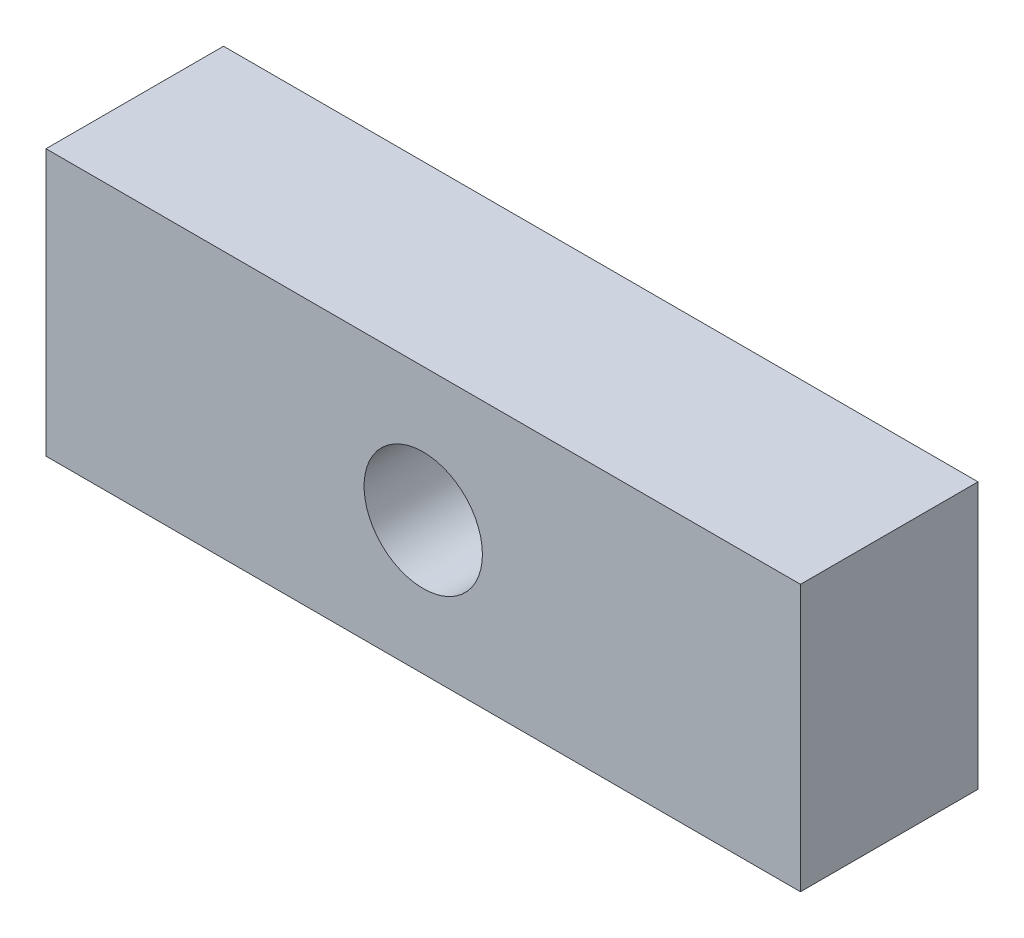
ISO-10303-21;
HEADER;
FILE_DESCRIPTION(('STEP AP214'),'2;1');
FILE_NAME('part.step','',(''),(''),'','','');
FILE_SCHEMA(('AUTOMOTIVE_DESIGN { 1 0 10303 214 1 1 1 1 }'));
ENDSEC;
DATA;
#1=APPLICATION_CONTEXT('core data for automotive mechanical design processes');
#2=APPLICATION_PROTOCOL_DEFINITION('international standard','automotive_design',2000,#1);
#3=PRODUCT_CONTEXT('',#1,'mechanical');
#4=PRODUCT('Part','Part','',(#3));
#5=PRODUCT_RELATED_PRODUCT_CATEGORY('part','',(#4));
#6=PRODUCT_DEFINITION_FORMATION('','',#4);
#7=PRODUCT_DEFINITION_CONTEXT('part definition',#1,'design');
#8=PRODUCT_DEFINITION('design','',#6,#7);
#9=PRODUCT_DEFINITION_SHAPE('','',#8);
#10=(LENGTH_UNIT() NAMED_UNIT(*) SI_UNIT(.MILLI.,.METRE.));
#11=(NAMED_UNIT(*) PLANE_ANGLE_UNIT() SI_UNIT($,.RADIAN.));
#12=(NAMED_UNIT(*) SI_UNIT($,.STERADIAN.) SOLID_ANGLE_UNIT());
#13=UNCERTAINTY_MEASURE_WITH_UNIT(LENGTH_MEASURE(1.E-05),#10,'distance_accuracy_value','');
#14=(GEOMETRIC_REPRESENTATION_CONTEXT(3) GLOBAL_UNCERTAINTY_ASSIGNED_CONTEXT((#13)) GLOBAL_UNIT_ASSIGNED_CONTEXT((#10,
#11,#12)) REPRESENTATION_CONTEXT('',''));
#15=CARTESIAN_POINT('',(0.,0.,0.));
#16=DIRECTION('',(0.,0.,1.));
#17=DIRECTION('',(1.,0.,0.));
#18=AXIS2_PLACEMENT_3D('',#15,#16,#17);
#19=CARTESIAN_POINT('',(0.,0.,3.));
#20=DIRECTION('',(1.,0.,0.));
#21=DIRECTION('',(0.,1.,0.));
#22=AXIS2_PLACEMENT_3D('',#19,#20,#21);
#23=PLANE('',#22);
#24=DIRECTION('',(0.,-1.,0.));
#25=VECTOR('',#24,1.);
#26=CARTESIAN_POINT('',(0.,0.,0.));
#27=LINE('',#26,#25);
#28=CARTESIAN_POINT('',(0.,0.,0.));
#29=VERTEX_POINT('',#28);
#30=CARTESIAN_POINT('',(0.,-4.5,0.));
#31=VERTEX_POINT('',#30);
#32=EDGE_CURVE('E96',#29,#31,#27,.T.);
#33=ORIENTED_EDGE('',*,*,#32,.T.);
#34=DIRECTION('',(0.,0.,-1.));
#35=VECTOR('',#34,1.);
#36=CARTESIAN_POINT('',(0.,-4.5,3.));
#37=LINE('',#36,#35);
#38=CARTESIAN_POINT('',(0.,-4.5,3.));
#39=VERTEX_POINT('',#38);
#40=EDGE_CURVE('E11',#39,#31,#37,.T.);
#41=ORIENTED_EDGE('',*,*,#40,.F.);
#42=DIRECTION('',(0.,-1.,0.));
#43=VECTOR('',#42,1.);
#44=CARTESIAN_POINT('',(0.,0.,3.));
#45=LINE('',#44,#43);
#46=CARTESIAN_POINT('',(0.,0.,3.));
#47=VERTEX_POINT('',#46);
#48=EDGE_CURVE('E84',#47,#39,#45,.T.);
#49=ORIENTED_EDGE('',*,*,#48,.F.);
#50=DIRECTION('',(0.,0.,-1.));
#51=VECTOR('',#50,1.);
#52=CARTESIAN_POINT('',(0.,0.,3.));
#53=LINE('',#52,#51);
#54=EDGE_CURVE('E92',#47,#29,#53,.T.);
#55=ORIENTED_EDGE('',*,*,#54,.T.);
#56=EDGE_LOOP('',(#33,#41,#49,#55));
#57=FACE_BOUND('',#56,.T.);
#58=ADVANCED_FACE('F33',(#57),#23,.F.);
#59=CARTESIAN_POINT('',(0.,-4.5,3.));
#60=DIRECTION('',(0.,1.,0.));
#61=DIRECTION('',(0.,0.,1.));
#62=AXIS2_PLACEMENT_3D('',#59,#60,#61);
#63=PLANE('',#62);
#64=DIRECTION('',(1.,0.,0.));
#65=VECTOR('',#64,1.);
#66=CARTESIAN_POINT('',(0.,-4.5,0.));
#67=LINE('',#66,#65);
#68=CARTESIAN_POINT('',(12.75,-4.5,0.));
#69=VERTEX_POINT('',#68);
#70=EDGE_CURVE('E88',#31,#69,#67,.T.);
#71=ORIENTED_EDGE('',*,*,#70,.T.);
#72=DIRECTION('',(0.,0.,-1.));
#73=VECTOR('',#72,1.);
#74=CARTESIAN_POINT('',(12.75,-4.5,3.));
#75=LINE('',#74,#73);
#76=CARTESIAN_POINT('',(12.75,-4.5,3.));
#77=VERTEX_POINT('',#76);
#78=EDGE_CURVE('E41',#77,#69,#75,.T.);
#79=ORIENTED_EDGE('',*,*,#78,.F.);
#80=DIRECTION('',(1.,0.,0.));
#81=VECTOR('',#80,1.);
#82=CARTESIAN_POINT('',(0.,-4.5,3.));
#83=LINE('',#82,#81);
#84=EDGE_CURVE('E79',#39,#77,#83,.T.);
#85=ORIENTED_EDGE('',*,*,#84,.F.);
#86=ORIENTED_EDGE('',*,*,#40,.T.);
#87=EDGE_LOOP('',(#71,#79,#85,#86));
#88=FACE_BOUND('',#87,.T.);
#89=ADVANCED_FACE('F87',(#88),#63,.F.);
#90=CARTESIAN_POINT('',(12.75,0.,3.));
#91=DIRECTION('',(-1.,0.,0.));
#92=DIRECTION('',(0.,0.,1.));
#93=AXIS2_PLACEMENT_3D('',#90,#91,#92);
#94=PLANE('',#93);
#95=DIRECTION('',(0.,1.,0.));
#96=VECTOR('',#95,1.);
#97=CARTESIAN_POINT('',(12.75,0.,0.));
#98=LINE('',#97,#96);
#99=CARTESIAN_POINT('',(12.75,0.,0.));
#100=VERTEX_POINT('',#99);
#101=EDGE_CURVE('E66',#69,#100,#98,.T.);
#102=ORIENTED_EDGE('',*,*,#101,.T.);
#103=DIRECTION('',(0.,0.,-1.));
#104=VECTOR('',#103,1.);
#105=CARTESIAN_POINT('',(12.75,0.,3.));
#106=LINE('',#105,#104);
#107=CARTESIAN_POINT('',(12.75,0.,3.));
#108=VERTEX_POINT('',#107);
#109=EDGE_CURVE('E89',#108,#100,#106,.T.);
#110=ORIENTED_EDGE('',*,*,#109,.F.);
#111=DIRECTION('',(0.,1.,0.));
#112=VECTOR('',#111,1.);
#113=CARTESIAN_POINT('',(12.75,0.,3.));
#114=LINE('',#113,#112);
#115=EDGE_CURVE('E82',#77,#108,#114,.T.);
#116=ORIENTED_EDGE('',*,*,#115,.F.);
#117=ORIENTED_EDGE('',*,*,#78,.T.);
#118=EDGE_LOOP('',(#102,#110,#116,#117));
#119=FACE_BOUND('',#118,.T.);
#120=ADVANCED_FACE('F90',(#119),#94,.F.);
#121=CARTESIAN_POINT('',(0.,0.,3.));
#122=DIRECTION('',(0.,-1.,0.));
#123=DIRECTION('',(0.,0.,-1.));
#124=AXIS2_PLACEMENT_3D('',#121,#122,#123);
#125=PLANE('',#124);
#126=DIRECTION('',(-1.,0.,0.));
#127=VECTOR('',#126,1.);
#128=CARTESIAN_POINT('',(0.,0.,0.));
#129=LINE('',#128,#127);
#130=EDGE_CURVE('E72',#100,#29,#129,.T.);
#131=ORIENTED_EDGE('',*,*,#130,.T.);
#132=ORIENTED_EDGE('',*,*,#54,.F.);
#133=DIRECTION('',(-1.,0.,0.));
#134=VECTOR('',#133,1.);
#135=CARTESIAN_POINT('',(0.,0.,3.));
#136=LINE('',#135,#134);
#137=EDGE_CURVE('E49',#108,#47,#136,.T.);
#138=ORIENTED_EDGE('',*,*,#137,.F.);
#139=ORIENTED_EDGE('',*,*,#109,.T.);
#140=EDGE_LOOP('',(#131,#132,#138,#139));
#141=FACE_BOUND('',#140,.T.);
#142=ADVANCED_FACE('F104',(#141),#125,.F.);
#143=CARTESIAN_POINT('',(0.,0.,3.));
#144=DIRECTION('',(0.,0.,1.));
#145=DIRECTION('',(1.,0.,0.));
#146=AXIS2_PLACEMENT_3D('',#143,#144,#145);
#147=PLANE('',#146);
#148=CARTESIAN_POINT('',(6.375,-2.25,3.));
#149=DIRECTION('',(0.,0.,1.));
#150=DIRECTION('',(1.,0.,0.));
#151=AXIS2_PLACEMENT_3D('',#148,#149,#150);
#152=CIRCLE('',#151,1.);
#153=CARTESIAN_POINT('',(7.375,-2.25,3.));
#154=VERTEX_POINT('',#153);
#155=EDGE_CURVE('E110',#154,#154,#152,.T.);
#156=ORIENTED_EDGE('',*,*,#155,.F.);
#157=EDGE_LOOP('',(#156));
#158=FACE_BOUND('',#157,.T.);
#159=ORIENTED_EDGE('',*,*,#48,.T.);
#160=ORIENTED_EDGE('',*,*,#84,.T.);
#161=ORIENTED_EDGE('',*,*,#115,.T.);
#162=ORIENTED_EDGE('',*,*,#137,.T.);
#163=EDGE_LOOP('',(#159,#160,#161,#162));
#164=FACE_BOUND('',#163,.T.);
#165=ADVANCED_FACE('F80',(#158,#164),#147,.T.);
#166=CARTESIAN_POINT('',(0.,0.,0.));
#167=DIRECTION('',(0.,0.,1.));
#168=DIRECTION('',(1.,0.,0.));
#169=AXIS2_PLACEMENT_3D('',#166,#167,#168);
#170=PLANE('',#169);
#171=CARTESIAN_POINT('',(6.375,-2.25,0.));
#172=DIRECTION('',(0.,0.,1.));
#173=DIRECTION('',(1.,0.,0.));
#174=AXIS2_PLACEMENT_3D('',#171,#172,#173);
#175=CIRCLE('',#174,1.);
#176=CARTESIAN_POINT('',(7.375,-2.25,0.));
#177=VERTEX_POINT('',#176);
#178=EDGE_CURVE('E99',#177,#177,#175,.T.);
#179=ORIENTED_EDGE('',*,*,#178,.T.);
#180=EDGE_LOOP('',(#179));
#181=FACE_BOUND('',#180,.T.);
#182=ORIENTED_EDGE('',*,*,#32,.F.);
#183=ORIENTED_EDGE('',*,*,#130,.F.);
#184=ORIENTED_EDGE('',*,*,#101,.F.);
#185=ORIENTED_EDGE('',*,*,#70,.F.);
#186=EDGE_LOOP('',(#182,#183,#184,#185));
#187=FACE_BOUND('',#186,.T.);
#188=ADVANCED_FACE('F107',(#181,#187),#170,.F.);
#189=CARTESIAN_POINT('',(6.375,-2.25,0.));
#190=DIRECTION('',(0.,0.,1.));
#191=DIRECTION('',(1.,0.,0.));
#192=AXIS2_PLACEMENT_3D('',#189,#190,#191);
#193=CYLINDRICAL_SURFACE('',#192,1.);
#194=ORIENTED_EDGE('',*,*,#178,.F.);
#195=EDGE_LOOP('',(#194));
#196=FACE_BOUND('',#195,.T.);
#197=ORIENTED_EDGE('',*,*,#155,.T.);
#198=EDGE_LOOP('',(#197));
#199=FACE_BOUND('',#198,.T.);
#200=ADVANCED_FACE('F117',(#196,#199),#193,.F.);
#201=CLOSED_SHELL('',(#58,#89,#120,#142,#165,#188,#200));
#202=MANIFOLD_SOLID_BREP('B2',#201);
#203=ADVANCED_BREP_SHAPE_REPRESENTATION('',(#18,#202),#14);
#204=SHAPE_DEFINITION_REPRESENTATION(#9,#203);
ENDSEC;
END-ISO-10303-21;
